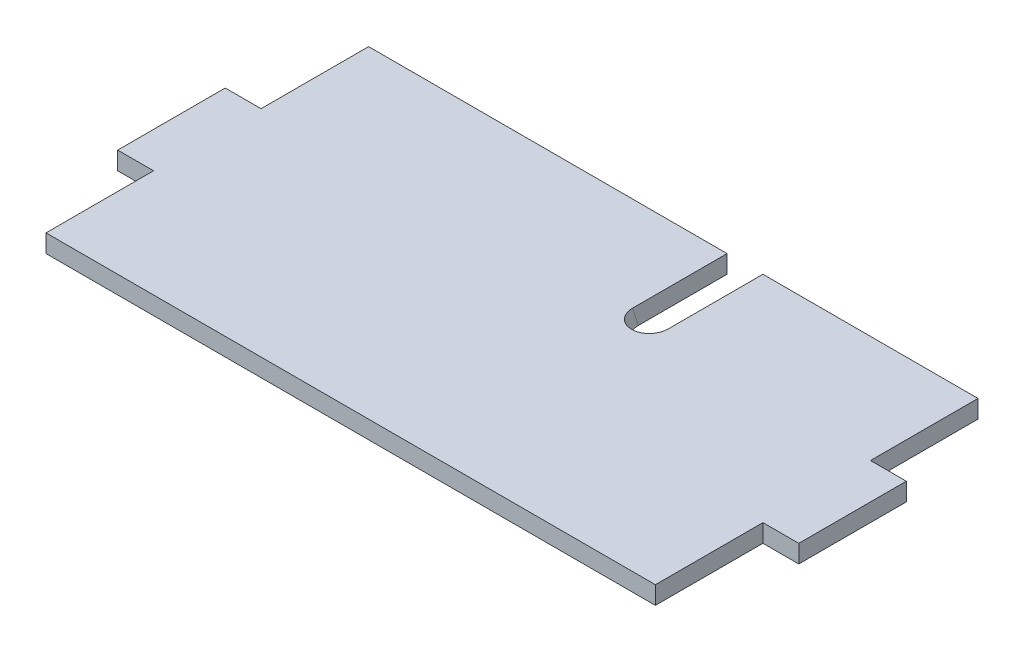
ISO-10303-21;
HEADER;
FILE_DESCRIPTION(('STEP AP214'),'2;1');
FILE_NAME('part.step','',(''),(''),'','','');
FILE_SCHEMA(('AUTOMOTIVE_DESIGN { 1 0 10303 214 1 1 1 1 }'));
ENDSEC;
DATA;
#1=APPLICATION_CONTEXT('core data for automotive mechanical design processes');
#2=APPLICATION_PROTOCOL_DEFINITION('international standard','automotive_design',2000,#1);
#3=PRODUCT_CONTEXT('',#1,'mechanical');
#4=PRODUCT('Part','Part','',(#3));
#5=PRODUCT_RELATED_PRODUCT_CATEGORY('part','',(#4));
#6=PRODUCT_DEFINITION_FORMATION('','',#4);
#7=PRODUCT_DEFINITION_CONTEXT('part definition',#1,'design');
#8=PRODUCT_DEFINITION('design','',#6,#7);
#9=PRODUCT_DEFINITION_SHAPE('','',#8);
#10=(LENGTH_UNIT() NAMED_UNIT(*) SI_UNIT(.MILLI.,.METRE.));
#11=(NAMED_UNIT(*) PLANE_ANGLE_UNIT() SI_UNIT($,.RADIAN.));
#12=(NAMED_UNIT(*) SI_UNIT($,.STERADIAN.) SOLID_ANGLE_UNIT());
#13=UNCERTAINTY_MEASURE_WITH_UNIT(LENGTH_MEASURE(1.E-05),#10,'distance_accuracy_value','');
#14=(GEOMETRIC_REPRESENTATION_CONTEXT(3) GLOBAL_UNCERTAINTY_ASSIGNED_CONTEXT((#13)) GLOBAL_UNIT_ASSIGNED_CONTEXT((#10,
#11,#12)) REPRESENTATION_CONTEXT('',''));
#15=CARTESIAN_POINT('',(0.,0.,0.));
#16=DIRECTION('',(0.,0.,1.));
#17=DIRECTION('',(1.,0.,0.));
#18=AXIS2_PLACEMENT_3D('',#15,#16,#17);
#19=CARTESIAN_POINT('',(-215.9,6.35,-88.9));
#20=DIRECTION('',(0.,0.,1.));
#21=DIRECTION('',(1.,0.,0.));
#22=AXIS2_PLACEMENT_3D('',#19,#20,#21);
#23=PLANE('',#22);
#24=DIRECTION('',(-1.,0.,0.));
#25=VECTOR('',#24,1.);
#26=CARTESIAN_POINT('',(-215.9,6.35,-88.9));
#27=LINE('',#26,#25);
#28=CARTESIAN_POINT('',(38.0999999999983,6.35,-88.9));
#29=VERTEX_POINT('',#28);
#30=CARTESIAN_POINT('',(-215.9,6.35,-88.9));
#31=VERTEX_POINT('',#30);
#32=EDGE_CURVE('E267',#29,#31,#27,.T.);
#33=ORIENTED_EDGE('',*,*,#32,.F.);
#34=DIRECTION('',(0.,1.,0.));
#35=VECTOR('',#34,1.);
#36=CARTESIAN_POINT('',(38.0999999999983,6.35,-88.9));
#37=LINE('',#36,#35);
#38=CARTESIAN_POINT('',(38.0999999999983,-6.35,-88.9));
#39=VERTEX_POINT('',#38);
#40=EDGE_CURVE('E369',#39,#29,#37,.T.);
#41=ORIENTED_EDGE('',*,*,#40,.F.);
#42=DIRECTION('',(-1.,0.,0.));
#43=VECTOR('',#42,1.);
#44=CARTESIAN_POINT('',(-215.9,-6.35,-88.9));
#45=LINE('',#44,#43);
#46=CARTESIAN_POINT('',(-215.9,-6.35,-88.9));
#47=VERTEX_POINT('',#46);
#48=EDGE_CURVE('E213',#39,#47,#45,.T.);
#49=ORIENTED_EDGE('',*,*,#48,.T.);
#50=DIRECTION('',(0.,-1.,0.));
#51=VECTOR('',#50,1.);
#52=CARTESIAN_POINT('',(-215.9,6.35,-88.9));
#53=LINE('',#52,#51);
#54=EDGE_CURVE('E219',#31,#47,#53,.T.);
#55=ORIENTED_EDGE('',*,*,#54,.F.);
#56=EDGE_LOOP('',(#33,#41,#49,#55));
#57=FACE_BOUND('',#56,.T.);
#58=ADVANCED_FACE('F46',(#57),#23,.F.);
#59=CARTESIAN_POINT('',(-215.9,6.35,-88.9));
#60=DIRECTION('',(1.,0.,0.));
#61=DIRECTION('',(0.,0.,-1.));
#62=AXIS2_PLACEMENT_3D('',#59,#60,#61);
#63=PLANE('',#62);
#64=DIRECTION('',(0.,0.,1.));
#65=VECTOR('',#64,1.);
#66=CARTESIAN_POINT('',(-215.9,-6.35,-88.9));
#67=LINE('',#66,#65);
#68=CARTESIAN_POINT('',(-215.9,-6.35,-12.7));
#69=VERTEX_POINT('',#68);
#70=EDGE_CURVE('E188',#47,#69,#67,.T.);
#71=ORIENTED_EDGE('',*,*,#70,.T.);
#72=DIRECTION('',(0.,-1.,0.));
#73=VECTOR('',#72,1.);
#74=CARTESIAN_POINT('',(-215.9,6.35,-12.7));
#75=LINE('',#74,#73);
#76=CARTESIAN_POINT('',(-215.9,6.35,-12.7));
#77=VERTEX_POINT('',#76);
#78=EDGE_CURVE('E259',#77,#69,#75,.T.);
#79=ORIENTED_EDGE('',*,*,#78,.F.);
#80=DIRECTION('',(0.,0.,1.));
#81=VECTOR('',#80,1.);
#82=CARTESIAN_POINT('',(-215.9,6.35,-88.9));
#83=LINE('',#82,#81);
#84=EDGE_CURVE('E199',#31,#77,#83,.T.);
#85=ORIENTED_EDGE('',*,*,#84,.F.);
#86=ORIENTED_EDGE('',*,*,#54,.T.);
#87=EDGE_LOOP('',(#71,#79,#85,#86));
#88=FACE_BOUND('',#87,.T.);
#89=ADVANCED_FACE('F399',(#88),#63,.F.);
#90=CARTESIAN_POINT('',(-241.3,6.35,-12.7));
#91=DIRECTION('',(0.,0.,1.));
#92=DIRECTION('',(1.,0.,0.));
#93=AXIS2_PLACEMENT_3D('',#90,#91,#92);
#94=PLANE('',#93);
#95=DIRECTION('',(-1.,0.,0.));
#96=VECTOR('',#95,1.);
#97=CARTESIAN_POINT('',(-241.3,-6.35,-12.7));
#98=LINE('',#97,#96);
#99=CARTESIAN_POINT('',(-241.3,-6.35,-12.7));
#100=VERTEX_POINT('',#99);
#101=EDGE_CURVE('E222',#69,#100,#98,.T.);
#102=ORIENTED_EDGE('',*,*,#101,.T.);
#103=DIRECTION('',(0.,-1.,0.));
#104=VECTOR('',#103,1.);
#105=CARTESIAN_POINT('',(-241.3,6.35,-12.7));
#106=LINE('',#105,#104);
#107=CARTESIAN_POINT('',(-241.3,6.35,-12.7));
#108=VERTEX_POINT('',#107);
#109=EDGE_CURVE('E255',#108,#100,#106,.T.);
#110=ORIENTED_EDGE('',*,*,#109,.F.);
#111=DIRECTION('',(-1.,0.,0.));
#112=VECTOR('',#111,1.);
#113=CARTESIAN_POINT('',(-241.3,6.35,-12.7));
#114=LINE('',#113,#112);
#115=EDGE_CURVE('E204',#77,#108,#114,.T.);
#116=ORIENTED_EDGE('',*,*,#115,.F.);
#117=ORIENTED_EDGE('',*,*,#78,.T.);
#118=EDGE_LOOP('',(#102,#110,#116,#117));
#119=FACE_BOUND('',#118,.T.);
#120=ADVANCED_FACE('F304',(#119),#94,.F.);
#121=CARTESIAN_POINT('',(-241.3,6.35,-12.7));
#122=DIRECTION('',(1.,0.,0.));
#123=DIRECTION('',(0.,0.,-1.));
#124=AXIS2_PLACEMENT_3D('',#121,#122,#123);
#125=PLANE('',#124);
#126=DIRECTION('',(0.,0.,1.));
#127=VECTOR('',#126,1.);
#128=CARTESIAN_POINT('',(-241.3,-6.35,-12.7));
#129=LINE('',#128,#127);
#130=CARTESIAN_POINT('',(-241.3,-6.35,63.5));
#131=VERTEX_POINT('',#130);
#132=EDGE_CURVE('E256',#100,#131,#129,.T.);
#133=ORIENTED_EDGE('',*,*,#132,.T.);
#134=DIRECTION('',(0.,-1.,0.));
#135=VECTOR('',#134,1.);
#136=CARTESIAN_POINT('',(-241.3,6.35,63.5));
#137=LINE('',#136,#135);
#138=CARTESIAN_POINT('',(-241.3,6.35,63.5));
#139=VERTEX_POINT('',#138);
#140=EDGE_CURVE('E251',#139,#131,#137,.T.);
#141=ORIENTED_EDGE('',*,*,#140,.F.);
#142=DIRECTION('',(0.,0.,1.));
#143=VECTOR('',#142,1.);
#144=CARTESIAN_POINT('',(-241.3,6.35,-12.7));
#145=LINE('',#144,#143);
#146=EDGE_CURVE('E292',#108,#139,#145,.T.);
#147=ORIENTED_EDGE('',*,*,#146,.F.);
#148=ORIENTED_EDGE('',*,*,#109,.T.);
#149=EDGE_LOOP('',(#133,#141,#147,#148));
#150=FACE_BOUND('',#149,.T.);
#151=ADVANCED_FACE('F309',(#150),#125,.F.);
#152=CARTESIAN_POINT('',(-215.9,6.35,63.5));
#153=DIRECTION('',(0.,0.,-1.));
#154=DIRECTION('',(-1.,0.,0.));
#155=AXIS2_PLACEMENT_3D('',#152,#153,#154);
#156=PLANE('',#155);
#157=DIRECTION('',(1.,0.,0.));
#158=VECTOR('',#157,1.);
#159=CARTESIAN_POINT('',(-215.9,-6.35,63.5));
#160=LINE('',#159,#158);
#161=CARTESIAN_POINT('',(-215.9,-6.35,63.5));
#162=VERTEX_POINT('',#161);
#163=EDGE_CURVE('E252',#131,#162,#160,.T.);
#164=ORIENTED_EDGE('',*,*,#163,.T.);
#165=DIRECTION('',(0.,-1.,0.));
#166=VECTOR('',#165,1.);
#167=CARTESIAN_POINT('',(-215.9,6.35,63.5));
#168=LINE('',#167,#166);
#169=CARTESIAN_POINT('',(-215.9,6.35,63.5));
#170=VERTEX_POINT('',#169);
#171=EDGE_CURVE('E247',#170,#162,#168,.T.);
#172=ORIENTED_EDGE('',*,*,#171,.F.);
#173=DIRECTION('',(1.,0.,0.));
#174=VECTOR('',#173,1.);
#175=CARTESIAN_POINT('',(-215.9,6.35,63.5));
#176=LINE('',#175,#174);
#177=EDGE_CURVE('E289',#139,#170,#176,.T.);
#178=ORIENTED_EDGE('',*,*,#177,.F.);
#179=ORIENTED_EDGE('',*,*,#140,.T.);
#180=EDGE_LOOP('',(#164,#172,#178,#179));
#181=FACE_BOUND('',#180,.T.);
#182=ADVANCED_FACE('F317',(#181),#156,.F.);
#183=CARTESIAN_POINT('',(-215.9,6.35,63.5));
#184=DIRECTION('',(1.,0.,0.));
#185=DIRECTION('',(0.,0.,-1.));
#186=AXIS2_PLACEMENT_3D('',#183,#184,#185);
#187=PLANE('',#186);
#188=DIRECTION('',(0.,0.,1.));
#189=VECTOR('',#188,1.);
#190=CARTESIAN_POINT('',(-215.9,-6.35,63.5));
#191=LINE('',#190,#189);
#192=CARTESIAN_POINT('',(-215.9,-6.35,139.7));
#193=VERTEX_POINT('',#192);
#194=EDGE_CURVE('E248',#162,#193,#191,.T.);
#195=ORIENTED_EDGE('',*,*,#194,.T.);
#196=DIRECTION('',(0.,-1.,0.));
#197=VECTOR('',#196,1.);
#198=CARTESIAN_POINT('',(-215.9,6.35,139.7));
#199=LINE('',#198,#197);
#200=CARTESIAN_POINT('',(-215.9,6.35,139.7));
#201=VERTEX_POINT('',#200);
#202=EDGE_CURVE('E243',#201,#193,#199,.T.);
#203=ORIENTED_EDGE('',*,*,#202,.F.);
#204=DIRECTION('',(0.,0.,1.));
#205=VECTOR('',#204,1.);
#206=CARTESIAN_POINT('',(-215.9,6.35,63.5));
#207=LINE('',#206,#205);
#208=EDGE_CURVE('E286',#170,#201,#207,.T.);
#209=ORIENTED_EDGE('',*,*,#208,.F.);
#210=ORIENTED_EDGE('',*,*,#171,.T.);
#211=EDGE_LOOP('',(#195,#203,#209,#210));
#212=FACE_BOUND('',#211,.T.);
#213=ADVANCED_FACE('F325',(#212),#187,.F.);
#214=CARTESIAN_POINT('',(-215.9,6.35,139.7));
#215=DIRECTION('',(0.,0.,-1.));
#216=DIRECTION('',(-1.,0.,0.));
#217=AXIS2_PLACEMENT_3D('',#214,#215,#216);
#218=PLANE('',#217);
#219=DIRECTION('',(1.,0.,0.));
#220=VECTOR('',#219,1.);
#221=CARTESIAN_POINT('',(-215.9,-6.35,139.7));
#222=LINE('',#221,#220);
#223=CARTESIAN_POINT('',(215.9,-6.35,139.7));
#224=VERTEX_POINT('',#223);
#225=EDGE_CURVE('E244',#193,#224,#222,.T.);
#226=ORIENTED_EDGE('',*,*,#225,.T.);
#227=DIRECTION('',(0.,-1.,0.));
#228=VECTOR('',#227,1.);
#229=CARTESIAN_POINT('',(215.9,6.35,139.7));
#230=LINE('',#229,#228);
#231=CARTESIAN_POINT('',(215.9,6.35,139.7));
#232=VERTEX_POINT('',#231);
#233=EDGE_CURVE('E239',#232,#224,#230,.T.);
#234=ORIENTED_EDGE('',*,*,#233,.F.);
#235=DIRECTION('',(1.,0.,0.));
#236=VECTOR('',#235,1.);
#237=CARTESIAN_POINT('',(-215.9,6.35,139.7));
#238=LINE('',#237,#236);
#239=EDGE_CURVE('E283',#201,#232,#238,.T.);
#240=ORIENTED_EDGE('',*,*,#239,.F.);
#241=ORIENTED_EDGE('',*,*,#202,.T.);
#242=EDGE_LOOP('',(#226,#234,#240,#241));
#243=FACE_BOUND('',#242,.T.);
#244=ADVANCED_FACE('F331',(#243),#218,.F.);
#245=CARTESIAN_POINT('',(215.9,6.35,63.5));
#246=DIRECTION('',(-1.,0.,0.));
#247=DIRECTION('',(0.,0.,1.));
#248=AXIS2_PLACEMENT_3D('',#245,#246,#247);
#249=PLANE('',#248);
#250=DIRECTION('',(0.,0.,-1.));
#251=VECTOR('',#250,1.);
#252=CARTESIAN_POINT('',(215.9,-6.35,63.5));
#253=LINE('',#252,#251);
#254=CARTESIAN_POINT('',(215.9,-6.35,63.5));
#255=VERTEX_POINT('',#254);
#256=EDGE_CURVE('E240',#224,#255,#253,.T.);
#257=ORIENTED_EDGE('',*,*,#256,.T.);
#258=DIRECTION('',(0.,-1.,0.));
#259=VECTOR('',#258,1.);
#260=CARTESIAN_POINT('',(215.9,6.35,63.5));
#261=LINE('',#260,#259);
#262=CARTESIAN_POINT('',(215.9,6.35,63.5));
#263=VERTEX_POINT('',#262);
#264=EDGE_CURVE('E235',#263,#255,#261,.T.);
#265=ORIENTED_EDGE('',*,*,#264,.F.);
#266=DIRECTION('',(0.,0.,-1.));
#267=VECTOR('',#266,1.);
#268=CARTESIAN_POINT('',(215.9,6.35,63.5));
#269=LINE('',#268,#267);
#270=EDGE_CURVE('E280',#232,#263,#269,.T.);
#271=ORIENTED_EDGE('',*,*,#270,.F.);
#272=ORIENTED_EDGE('',*,*,#233,.T.);
#273=EDGE_LOOP('',(#257,#265,#271,#272));
#274=FACE_BOUND('',#273,.T.);
#275=ADVANCED_FACE('F339',(#274),#249,.F.);
#276=CARTESIAN_POINT('',(215.9,6.35,63.5));
#277=DIRECTION('',(0.,0.,-1.));
#278=DIRECTION('',(-1.,0.,0.));
#279=AXIS2_PLACEMENT_3D('',#276,#277,#278);
#280=PLANE('',#279);
#281=DIRECTION('',(1.,0.,0.));
#282=VECTOR('',#281,1.);
#283=CARTESIAN_POINT('',(215.9,-6.35,63.5));
#284=LINE('',#283,#282);
#285=CARTESIAN_POINT('',(241.3,-6.35,63.5));
#286=VERTEX_POINT('',#285);
#287=EDGE_CURVE('E236',#255,#286,#284,.T.);
#288=ORIENTED_EDGE('',*,*,#287,.T.);
#289=DIRECTION('',(0.,-1.,0.));
#290=VECTOR('',#289,1.);
#291=CARTESIAN_POINT('',(241.3,6.35,63.5));
#292=LINE('',#291,#290);
#293=CARTESIAN_POINT('',(241.3,6.35,63.5));
#294=VERTEX_POINT('',#293);
#295=EDGE_CURVE('E231',#294,#286,#292,.T.);
#296=ORIENTED_EDGE('',*,*,#295,.F.);
#297=DIRECTION('',(1.,0.,0.));
#298=VECTOR('',#297,1.);
#299=CARTESIAN_POINT('',(215.9,6.35,63.5));
#300=LINE('',#299,#298);
#301=EDGE_CURVE('E277',#263,#294,#300,.T.);
#302=ORIENTED_EDGE('',*,*,#301,.F.);
#303=ORIENTED_EDGE('',*,*,#264,.T.);
#304=EDGE_LOOP('',(#288,#296,#302,#303));
#305=FACE_BOUND('',#304,.T.);
#306=ADVANCED_FACE('F347',(#305),#280,.F.);
#307=CARTESIAN_POINT('',(241.3,6.35,-12.7));
#308=DIRECTION('',(-1.,0.,0.));
#309=DIRECTION('',(0.,0.,1.));
#310=AXIS2_PLACEMENT_3D('',#307,#308,#309);
#311=PLANE('',#310);
#312=DIRECTION('',(0.,0.,-1.));
#313=VECTOR('',#312,1.);
#314=CARTESIAN_POINT('',(241.3,-6.35,-12.7));
#315=LINE('',#314,#313);
#316=CARTESIAN_POINT('',(241.3,-6.35,-12.7));
#317=VERTEX_POINT('',#316);
#318=EDGE_CURVE('E232',#286,#317,#315,.T.);
#319=ORIENTED_EDGE('',*,*,#318,.T.);
#320=DIRECTION('',(0.,-1.,0.));
#321=VECTOR('',#320,1.);
#322=CARTESIAN_POINT('',(241.3,6.35,-12.7));
#323=LINE('',#322,#321);
#324=CARTESIAN_POINT('',(241.3,6.35,-12.7));
#325=VERTEX_POINT('',#324);
#326=EDGE_CURVE('E227',#325,#317,#323,.T.);
#327=ORIENTED_EDGE('',*,*,#326,.F.);
#328=DIRECTION('',(0.,0.,-1.));
#329=VECTOR('',#328,1.);
#330=CARTESIAN_POINT('',(241.3,6.35,-12.7));
#331=LINE('',#330,#329);
#332=EDGE_CURVE('E274',#294,#325,#331,.T.);
#333=ORIENTED_EDGE('',*,*,#332,.F.);
#334=ORIENTED_EDGE('',*,*,#295,.T.);
#335=EDGE_LOOP('',(#319,#327,#333,#334));
#336=FACE_BOUND('',#335,.T.);
#337=ADVANCED_FACE('F353',(#336),#311,.F.);
#338=CARTESIAN_POINT('',(241.3,6.35,-12.7));
#339=DIRECTION('',(0.,0.,1.));
#340=DIRECTION('',(1.,0.,0.));
#341=AXIS2_PLACEMENT_3D('',#338,#339,#340);
#342=PLANE('',#341);
#343=DIRECTION('',(-1.,0.,0.));
#344=VECTOR('',#343,1.);
#345=CARTESIAN_POINT('',(241.3,-6.35,-12.7));
#346=LINE('',#345,#344);
#347=CARTESIAN_POINT('',(215.9,-6.35,-12.7));
#348=VERTEX_POINT('',#347);
#349=EDGE_CURVE('E228',#317,#348,#346,.T.);
#350=ORIENTED_EDGE('',*,*,#349,.T.);
#351=DIRECTION('',(0.,-1.,0.));
#352=VECTOR('',#351,1.);
#353=CARTESIAN_POINT('',(215.9,6.35,-12.7));
#354=LINE('',#353,#352);
#355=CARTESIAN_POINT('',(215.9,6.35,-12.7));
#356=VERTEX_POINT('',#355);
#357=EDGE_CURVE('E217',#356,#348,#354,.T.);
#358=ORIENTED_EDGE('',*,*,#357,.F.);
#359=DIRECTION('',(-1.,0.,0.));
#360=VECTOR('',#359,1.);
#361=CARTESIAN_POINT('',(241.3,6.35,-12.7));
#362=LINE('',#361,#360);
#363=EDGE_CURVE('E271',#325,#356,#362,.T.);
#364=ORIENTED_EDGE('',*,*,#363,.F.);
#365=ORIENTED_EDGE('',*,*,#326,.T.);
#366=EDGE_LOOP('',(#350,#358,#364,#365));
#367=FACE_BOUND('',#366,.T.);
#368=ADVANCED_FACE('F360',(#367),#342,.F.);
#369=CARTESIAN_POINT('',(215.9,6.35,-88.9));
#370=DIRECTION('',(-1.,0.,0.));
#371=DIRECTION('',(0.,0.,1.));
#372=AXIS2_PLACEMENT_3D('',#369,#370,#371);
#373=PLANE('',#372);
#374=DIRECTION('',(0.,0.,-1.));
#375=VECTOR('',#374,1.);
#376=CARTESIAN_POINT('',(215.9,-6.35,-88.9));
#377=LINE('',#376,#375);
#378=CARTESIAN_POINT('',(215.9,-6.35,-88.9));
#379=VERTEX_POINT('',#378);
#380=EDGE_CURVE('E224',#348,#379,#377,.T.);
#381=ORIENTED_EDGE('',*,*,#380,.T.);
#382=DIRECTION('',(0.,-1.,0.));
#383=VECTOR('',#382,1.);
#384=CARTESIAN_POINT('',(215.9,6.35,-88.9));
#385=LINE('',#384,#383);
#386=CARTESIAN_POINT('',(215.9,6.35,-88.9));
#387=VERTEX_POINT('',#386);
#388=EDGE_CURVE('E200',#387,#379,#385,.T.);
#389=ORIENTED_EDGE('',*,*,#388,.F.);
#390=DIRECTION('',(0.,0.,-1.));
#391=VECTOR('',#390,1.);
#392=CARTESIAN_POINT('',(215.9,6.35,-88.9));
#393=LINE('',#392,#391);
#394=EDGE_CURVE('E268',#356,#387,#393,.T.);
#395=ORIENTED_EDGE('',*,*,#394,.F.);
#396=ORIENTED_EDGE('',*,*,#357,.T.);
#397=EDGE_LOOP('',(#381,#389,#395,#396));
#398=FACE_BOUND('',#397,.T.);
#399=ADVANCED_FACE('F364',(#398),#373,.F.);
#400=CARTESIAN_POINT('',(63.4999999999985,-6.35,-88.9));
#401=VERTEX_POINT('',#400);
#402=EDGE_CURVE('E206',#379,#401,#45,.T.);
#403=ORIENTED_EDGE('',*,*,#402,.T.);
#404=DIRECTION('',(0.,-1.,0.));
#405=VECTOR('',#404,1.);
#406=CARTESIAN_POINT('',(63.4999999999985,6.34999999999997,-88.9));
#407=LINE('',#406,#405);
#408=CARTESIAN_POINT('',(63.4999999999985,6.34999999999997,-88.9));
#409=VERTEX_POINT('',#408);
#410=EDGE_CURVE('E367',#409,#401,#407,.T.);
#411=ORIENTED_EDGE('',*,*,#410,.F.);
#412=EDGE_CURVE('E56',#387,#409,#27,.T.);
#413=ORIENTED_EDGE('',*,*,#412,.F.);
#414=ORIENTED_EDGE('',*,*,#388,.T.);
#415=EDGE_LOOP('',(#403,#411,#413,#414));
#416=FACE_BOUND('',#415,.T.);
#417=ADVANCED_FACE('F366',(#416),#23,.F.);
#418=CARTESIAN_POINT('',(0.,6.35,0.));
#419=DIRECTION('',(0.,1.,0.));
#420=DIRECTION('',(0.,0.,1.));
#421=AXIS2_PLACEMENT_3D('',#418,#419,#420);
#422=PLANE('',#421);
#423=DIRECTION('',(0.,0.,-1.));
#424=VECTOR('',#423,1.);
#425=CARTESIAN_POINT('',(38.0999999999983,6.35,139.701));
#426=LINE('',#425,#424);
#427=CARTESIAN_POINT('',(38.0999999999983,6.34999999999997,-21.9362936905283));
#428=VERTEX_POINT('',#427);
#429=EDGE_CURVE('E78',#428,#29,#426,.T.);
#430=ORIENTED_EDGE('',*,*,#429,.T.);
#431=ORIENTED_EDGE('',*,*,#32,.T.);
#432=ORIENTED_EDGE('',*,*,#84,.T.);
#433=ORIENTED_EDGE('',*,*,#115,.T.);
#434=ORIENTED_EDGE('',*,*,#146,.T.);
#435=ORIENTED_EDGE('',*,*,#177,.T.);
#436=ORIENTED_EDGE('',*,*,#208,.T.);
#437=ORIENTED_EDGE('',*,*,#239,.T.);
#438=ORIENTED_EDGE('',*,*,#270,.T.);
#439=ORIENTED_EDGE('',*,*,#301,.T.);
#440=ORIENTED_EDGE('',*,*,#332,.T.);
#441=ORIENTED_EDGE('',*,*,#363,.T.);
#442=ORIENTED_EDGE('',*,*,#394,.T.);
#443=ORIENTED_EDGE('',*,*,#412,.T.);
#444=DIRECTION('',(0.,0.,-1.));
#445=VECTOR('',#444,1.);
#446=CARTESIAN_POINT('',(63.4999999999985,6.34999999999997,139.701));
#447=LINE('',#446,#445);
#448=CARTESIAN_POINT('',(63.4999999999985,6.34999999999997,-21.9362936905283));
#449=VERTEX_POINT('',#448);
#450=EDGE_CURVE('E182',#449,#409,#447,.T.);
#451=ORIENTED_EDGE('',*,*,#450,.F.);
#452=CARTESIAN_POINT('',(50.7999999999984,6.34999999999997,-21.9362936905283));
#453=DIRECTION('',(0.,1.,0.));
#454=DIRECTION('',(0.,0.,-1.));
#455=AXIS2_PLACEMENT_3D('',#452,#453,#454);
#456=ELLIPSE('',#455,13.3666923712586,12.7000000000001);
#457=EDGE_CURVE('E50',#449,#428,#456,.F.);
#458=ORIENTED_EDGE('',*,*,#457,.T.);
#459=EDGE_LOOP('',(#430,#431,#432,#433,#434,#435,#436,#437,#438,#439,#440,#441,#442,#443,#451,#458));
#460=FACE_BOUND('',#459,.T.);
#461=ADVANCED_FACE('F48',(#460),#422,.T.);
#462=CARTESIAN_POINT('',(0.,-6.35,0.));
#463=DIRECTION('',(0.,1.,0.));
#464=DIRECTION('',(0.,0.,1.));
#465=AXIS2_PLACEMENT_3D('',#462,#463,#464);
#466=PLANE('',#465);
#467=ORIENTED_EDGE('',*,*,#48,.F.);
#468=DIRECTION('',(0.,0.,-1.));
#469=VECTOR('',#468,1.);
#470=CARTESIAN_POINT('',(38.0999999999983,-6.35,139.701));
#471=LINE('',#470,#469);
#472=CARTESIAN_POINT('',(38.0999999999983,-6.34999999999997,-26.1050422974676));
#473=VERTEX_POINT('',#472);
#474=EDGE_CURVE('E377',#473,#39,#471,.T.);
#475=ORIENTED_EDGE('',*,*,#474,.F.);
#476=CARTESIAN_POINT('',(50.7999999999984,-6.34999999999997,-26.1050422974676));
#477=DIRECTION('',(0.,1.,0.));
#478=DIRECTION('',(0.,0.,-1.));
#479=AXIS2_PLACEMENT_3D('',#476,#477,#478);
#480=ELLIPSE('',#479,13.3666923712586,12.7000000000001);
#481=CARTESIAN_POINT('',(63.4999999999985,-6.34999999999997,-26.1050422974676));
#482=VERTEX_POINT('',#481);
#483=EDGE_CURVE('E11',#482,#473,#480,.F.);
#484=ORIENTED_EDGE('',*,*,#483,.F.);
#485=DIRECTION('',(0.,0.,-1.));
#486=VECTOR('',#485,1.);
#487=CARTESIAN_POINT('',(63.4999999999985,-6.35,139.701));
#488=LINE('',#487,#486);
#489=EDGE_CURVE('E67',#482,#401,#488,.T.);
#490=ORIENTED_EDGE('',*,*,#489,.T.);
#491=ORIENTED_EDGE('',*,*,#402,.F.);
#492=ORIENTED_EDGE('',*,*,#380,.F.);
#493=ORIENTED_EDGE('',*,*,#349,.F.);
#494=ORIENTED_EDGE('',*,*,#318,.F.);
#495=ORIENTED_EDGE('',*,*,#287,.F.);
#496=ORIENTED_EDGE('',*,*,#256,.F.);
#497=ORIENTED_EDGE('',*,*,#225,.F.);
#498=ORIENTED_EDGE('',*,*,#194,.F.);
#499=ORIENTED_EDGE('',*,*,#163,.F.);
#500=ORIENTED_EDGE('',*,*,#132,.F.);
#501=ORIENTED_EDGE('',*,*,#101,.F.);
#502=ORIENTED_EDGE('',*,*,#70,.F.);
#503=EDGE_LOOP('',(#467,#475,#484,#490,#491,#492,#493,#494,#495,#496,#497,#498,#499,#500,#501,#502));
#504=FACE_BOUND('',#503,.T.);
#505=ADVANCED_FACE('F389',(#504),#466,.F.);
#506=CARTESIAN_POINT('',(50.7999999999984,588.695351800179,169.21735781141));
#507=DIRECTION('',(0.,-0.950122861158083,-0.311875854635749));
#508=DIRECTION('',(0.,0.311875854635749,-0.950122861158082));
#509=AXIS2_PLACEMENT_3D('',#506,#507,#508);
#510=CYLINDRICAL_SURFACE('',#509,12.7000000000001);
#511=DIRECTION('',(0.,-0.950122861158083,-0.311875854635749));
#512=VECTOR('',#511,1.);
#513=CARTESIAN_POINT('',(38.0999999999983,588.695351800179,169.21735781141));
#514=LINE('',#513,#512);
#515=EDGE_CURVE('E189',#473,#428,#514,.F.);
#516=ORIENTED_EDGE('',*,*,#515,.T.);
#517=ORIENTED_EDGE('',*,*,#457,.F.);
#518=DIRECTION('',(0.,-0.950122861158083,-0.311875854635749));
#519=VECTOR('',#518,1.);
#520=CARTESIAN_POINT('',(63.4999999999985,588.695351800179,169.21735781141));
#521=LINE('',#520,#519);
#522=EDGE_CURVE('E179',#482,#449,#521,.F.);
#523=ORIENTED_EDGE('',*,*,#522,.F.);
#524=ORIENTED_EDGE('',*,*,#483,.T.);
#525=EDGE_LOOP('',(#516,#517,#523,#524));
#526=FACE_BOUND('',#525,.T.);
#527=ADVANCED_FACE('F197',(#526),#510,.F.);
#528=CARTESIAN_POINT('',(63.4999999999985,6.34999999999997,139.701));
#529=DIRECTION('',(1.,0.,0.));
#530=DIRECTION('',(0.,0.,-1.));
#531=AXIS2_PLACEMENT_3D('',#528,#529,#530);
#532=PLANE('',#531);
#533=ORIENTED_EDGE('',*,*,#522,.T.);
#534=ORIENTED_EDGE('',*,*,#450,.T.);
#535=ORIENTED_EDGE('',*,*,#410,.T.);
#536=ORIENTED_EDGE('',*,*,#489,.F.);
#537=EDGE_LOOP('',(#533,#534,#535,#536));
#538=FACE_BOUND('',#537,.T.);
#539=ADVANCED_FACE('F181',(#538),#532,.F.);
#540=CARTESIAN_POINT('',(38.0999999999983,6.35,139.701));
#541=DIRECTION('',(-1.,0.,0.));
#542=DIRECTION('',(0.,0.,1.));
#543=AXIS2_PLACEMENT_3D('',#540,#541,#542);
#544=PLANE('',#543);
#545=ORIENTED_EDGE('',*,*,#474,.T.);
#546=ORIENTED_EDGE('',*,*,#40,.T.);
#547=ORIENTED_EDGE('',*,*,#429,.F.);
#548=ORIENTED_EDGE('',*,*,#515,.F.);
#549=EDGE_LOOP('',(#545,#546,#547,#548));
#550=FACE_BOUND('',#549,.T.);
#551=ADVANCED_FACE('F459',(#550),#544,.F.);
#552=CLOSED_SHELL('',(#58,#89,#120,#151,#182,#213,#244,#275,#306,#337,#368,#399,#417,#461,#505,
#527,#539,#551));
#553=MANIFOLD_SOLID_BREP('B2',#552);
#554=ADVANCED_BREP_SHAPE_REPRESENTATION('',(#18,#553),#14);
#555=SHAPE_DEFINITION_REPRESENTATION(#9,#554);
ENDSEC;
END-ISO-10303-21;
